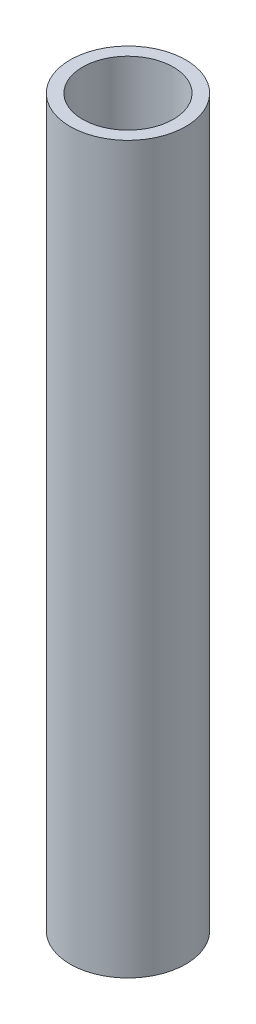
ISO-10303-21;
HEADER;
FILE_DESCRIPTION(('STEP AP214'),'2;1');
FILE_NAME('part.step','',(''),(''),'','','');
FILE_SCHEMA(('AUTOMOTIVE_DESIGN { 1 0 10303 214 1 1 1 1 }'));
ENDSEC;
DATA;
#1=APPLICATION_CONTEXT('core data for automotive mechanical design processes');
#2=APPLICATION_PROTOCOL_DEFINITION('international standard','automotive_design',2000,#1);
#3=PRODUCT_CONTEXT('',#1,'mechanical');
#4=PRODUCT('Part','Part','',(#3));
#5=PRODUCT_RELATED_PRODUCT_CATEGORY('part','',(#4));
#6=PRODUCT_DEFINITION_FORMATION('','',#4);
#7=PRODUCT_DEFINITION_CONTEXT('part definition',#1,'design');
#8=PRODUCT_DEFINITION('design','',#6,#7);
#9=PRODUCT_DEFINITION_SHAPE('','',#8);
#10=(LENGTH_UNIT() NAMED_UNIT(*) SI_UNIT(.MILLI.,.METRE.));
#11=(NAMED_UNIT(*) PLANE_ANGLE_UNIT() SI_UNIT($,.RADIAN.));
#12=(NAMED_UNIT(*) SI_UNIT($,.STERADIAN.) SOLID_ANGLE_UNIT());
#13=UNCERTAINTY_MEASURE_WITH_UNIT(LENGTH_MEASURE(1.E-05),#10,'distance_accuracy_value','');
#14=(GEOMETRIC_REPRESENTATION_CONTEXT(3) GLOBAL_UNCERTAINTY_ASSIGNED_CONTEXT((#13)) GLOBAL_UNIT_ASSIGNED_CONTEXT((#10,
#11,#12)) REPRESENTATION_CONTEXT('',''));
#15=CARTESIAN_POINT('',(0.,0.,0.));
#16=DIRECTION('',(0.,0.,1.));
#17=DIRECTION('',(1.,0.,0.));
#18=AXIS2_PLACEMENT_3D('',#15,#16,#17);
#19=CARTESIAN_POINT('',(0.,152.4,0.));
#20=DIRECTION('',(0.,1.,0.));
#21=DIRECTION('',(0.,0.,1.));
#22=AXIS2_PLACEMENT_3D('',#19,#20,#21);
#23=PLANE('',#22);
#24=CARTESIAN_POINT('',(0.,152.4,0.));
#25=DIRECTION('',(0.,1.,0.));
#26=DIRECTION('',(0.,0.,1.));
#27=AXIS2_PLACEMENT_3D('',#24,#25,#26);
#28=CIRCLE('',#27,24.2824);
#29=CARTESIAN_POINT('',(0.,152.4,24.2824));
#30=VERTEX_POINT('',#29);
#31=EDGE_CURVE('E10',#30,#30,#28,.T.);
#32=ORIENTED_EDGE('',*,*,#31,.T.);
#33=EDGE_LOOP('',(#32));
#34=FACE_BOUND('',#33,.T.);
#35=CARTESIAN_POINT('',(0.,152.4,0.));
#36=DIRECTION('',(0.,1.,0.));
#37=DIRECTION('',(0.,0.,1.));
#38=AXIS2_PLACEMENT_3D('',#35,#36,#37);
#39=CIRCLE('',#38,19.05);
#40=CARTESIAN_POINT('',(0.,152.4,19.05));
#41=VERTEX_POINT('',#40);
#42=EDGE_CURVE('E42',#41,#41,#39,.T.);
#43=ORIENTED_EDGE('',*,*,#42,.F.);
#44=EDGE_LOOP('',(#43));
#45=FACE_BOUND('',#44,.T.);
#46=ADVANCED_FACE('F31',(#34,#45),#23,.T.);
#47=CARTESIAN_POINT('',(0.,-152.4,0.));
#48=DIRECTION('',(0.,1.,0.));
#49=DIRECTION('',(0.,0.,1.));
#50=AXIS2_PLACEMENT_3D('',#47,#48,#49);
#51=PLANE('',#50);
#52=CARTESIAN_POINT('',(0.,-152.4,0.));
#53=DIRECTION('',(0.,1.,0.));
#54=DIRECTION('',(0.,0.,1.));
#55=AXIS2_PLACEMENT_3D('',#52,#53,#54);
#56=CIRCLE('',#55,24.2824);
#57=CARTESIAN_POINT('',(0.,-152.4,24.2824));
#58=VERTEX_POINT('',#57);
#59=EDGE_CURVE('E35',#58,#58,#56,.T.);
#60=ORIENTED_EDGE('',*,*,#59,.F.);
#61=EDGE_LOOP('',(#60));
#62=FACE_BOUND('',#61,.T.);
#63=CARTESIAN_POINT('',(0.,-152.4,0.));
#64=DIRECTION('',(0.,1.,0.));
#65=DIRECTION('',(0.,0.,1.));
#66=AXIS2_PLACEMENT_3D('',#63,#64,#65);
#67=CIRCLE('',#66,19.05);
#68=CARTESIAN_POINT('',(0.,-152.4,19.05));
#69=VERTEX_POINT('',#68);
#70=EDGE_CURVE('E44',#69,#69,#67,.T.);
#71=ORIENTED_EDGE('',*,*,#70,.T.);
#72=EDGE_LOOP('',(#71));
#73=FACE_BOUND('',#72,.T.);
#74=ADVANCED_FACE('F54',(#62,#73),#51,.F.);
#75=CARTESIAN_POINT('',(0.,152.4,0.));
#76=DIRECTION('',(0.,-1.,0.));
#77=DIRECTION('',(0.,0.,-1.));
#78=AXIS2_PLACEMENT_3D('',#75,#76,#77);
#79=CYLINDRICAL_SURFACE('',#78,24.2824);
#80=ORIENTED_EDGE('',*,*,#31,.F.);
#81=EDGE_LOOP('',(#80));
#82=FACE_BOUND('',#81,.T.);
#83=ORIENTED_EDGE('',*,*,#59,.T.);
#84=EDGE_LOOP('',(#83));
#85=FACE_BOUND('',#84,.T.);
#86=ADVANCED_FACE('F33',(#82,#85),#79,.T.);
#87=CARTESIAN_POINT('',(0.,152.4,0.));
#88=DIRECTION('',(0.,-1.,0.));
#89=DIRECTION('',(0.,0.,-1.));
#90=AXIS2_PLACEMENT_3D('',#87,#88,#89);
#91=CYLINDRICAL_SURFACE('',#90,19.05);
#92=ORIENTED_EDGE('',*,*,#42,.T.);
#93=EDGE_LOOP('',(#92));
#94=FACE_BOUND('',#93,.T.);
#95=ORIENTED_EDGE('',*,*,#70,.F.);
#96=EDGE_LOOP('',(#95));
#97=FACE_BOUND('',#96,.T.);
#98=ADVANCED_FACE('F50',(#94,#97),#91,.F.);
#99=CLOSED_SHELL('',(#46,#74,#86,#98));
#100=MANIFOLD_SOLID_BREP('B2',#99);
#101=ADVANCED_BREP_SHAPE_REPRESENTATION('',(#18,#100),#14);
#102=SHAPE_DEFINITION_REPRESENTATION(#9,#101);
ENDSEC;
END-ISO-10303-21;
